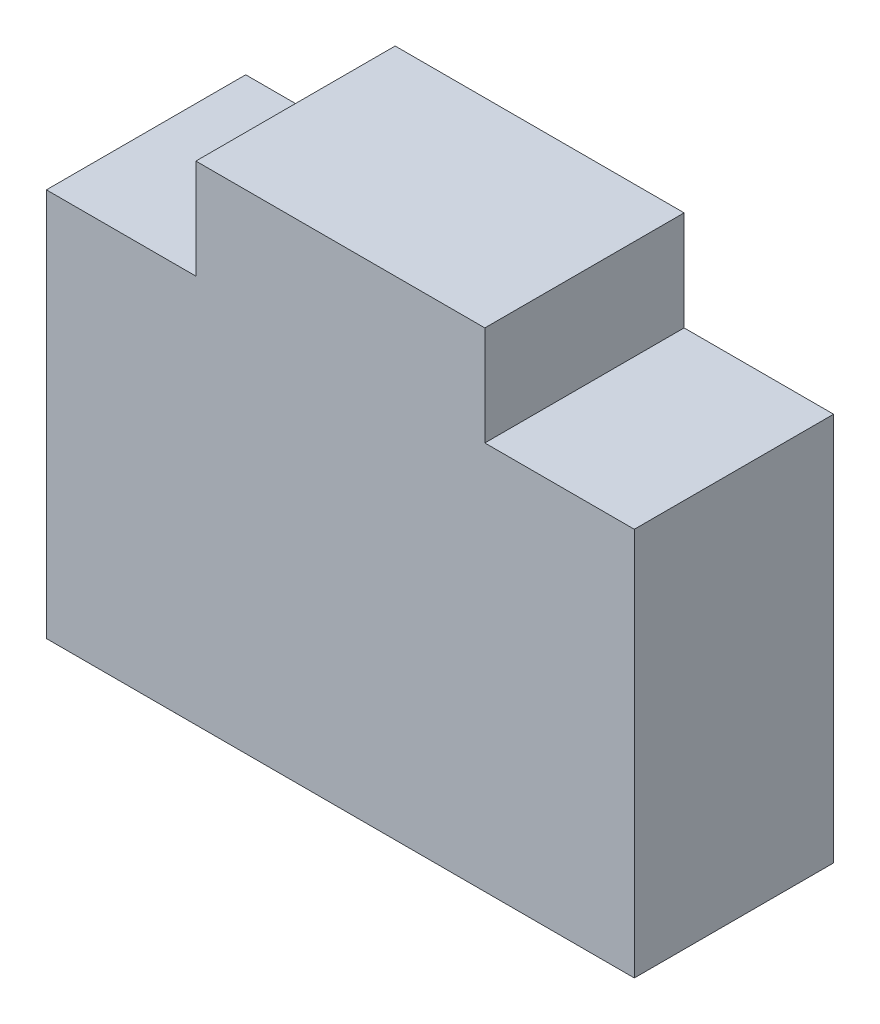
ISO-10303-21;
HEADER;
FILE_DESCRIPTION(('STEP AP214'),'2;1');
FILE_NAME('part.step','',(''),(''),'','','');
FILE_SCHEMA(('AUTOMOTIVE_DESIGN { 1 0 10303 214 1 1 1 1 }'));
ENDSEC;
DATA;
#1=APPLICATION_CONTEXT('core data for automotive mechanical design processes');
#2=APPLICATION_PROTOCOL_DEFINITION('international standard','automotive_design',2000,#1);
#3=PRODUCT_CONTEXT('',#1,'mechanical');
#4=PRODUCT('Part','Part','',(#3));
#5=PRODUCT_RELATED_PRODUCT_CATEGORY('part','',(#4));
#6=PRODUCT_DEFINITION_FORMATION('','',#4);
#7=PRODUCT_DEFINITION_CONTEXT('part definition',#1,'design');
#8=PRODUCT_DEFINITION('design','',#6,#7);
#9=PRODUCT_DEFINITION_SHAPE('','',#8);
#10=(LENGTH_UNIT() NAMED_UNIT(*) SI_UNIT(.MILLI.,.METRE.));
#11=(NAMED_UNIT(*) PLANE_ANGLE_UNIT() SI_UNIT($,.RADIAN.));
#12=(NAMED_UNIT(*) SI_UNIT($,.STERADIAN.) SOLID_ANGLE_UNIT());
#13=UNCERTAINTY_MEASURE_WITH_UNIT(LENGTH_MEASURE(1.E-05),#10,'distance_accuracy_value','');
#14=(GEOMETRIC_REPRESENTATION_CONTEXT(3) GLOBAL_UNCERTAINTY_ASSIGNED_CONTEXT((#13)) GLOBAL_UNIT_ASSIGNED_CONTEXT((#10,
#11,#12)) REPRESENTATION_CONTEXT('',''));
#15=CARTESIAN_POINT('',(0.,0.,0.));
#16=DIRECTION('',(0.,0.,1.));
#17=DIRECTION('',(1.,0.,0.));
#18=AXIS2_PLACEMENT_3D('',#15,#16,#17);
#19=CARTESIAN_POINT('',(1.45,0.,2.));
#20=DIRECTION('',(-1.,0.,0.));
#21=DIRECTION('',(0.,-1.,0.));
#22=AXIS2_PLACEMENT_3D('',#19,#20,#21);
#23=PLANE('',#22);
#24=DIRECTION('',(0.,1.,0.));
#25=VECTOR('',#24,1.);
#26=CARTESIAN_POINT('',(1.45,0.,0.));
#27=LINE('',#26,#25);
#28=CARTESIAN_POINT('',(1.45,-1.,0.));
#29=VERTEX_POINT('',#28);
#30=CARTESIAN_POINT('',(1.45,0.,0.));
#31=VERTEX_POINT('',#30);
#32=EDGE_CURVE('E129',#29,#31,#27,.T.);
#33=ORIENTED_EDGE('',*,*,#32,.T.);
#34=DIRECTION('',(0.,0.,-1.));
#35=VECTOR('',#34,1.);
#36=CARTESIAN_POINT('',(1.45,0.,2.));
#37=LINE('',#36,#35);
#38=CARTESIAN_POINT('',(1.45,0.,2.));
#39=VERTEX_POINT('',#38);
#40=EDGE_CURVE('E11',#39,#31,#37,.T.);
#41=ORIENTED_EDGE('',*,*,#40,.F.);
#42=DIRECTION('',(0.,1.,0.));
#43=VECTOR('',#42,1.);
#44=CARTESIAN_POINT('',(1.45,0.,2.));
#45=LINE('',#44,#43);
#46=CARTESIAN_POINT('',(1.45,-1.,2.));
#47=VERTEX_POINT('',#46);
#48=EDGE_CURVE('E143',#47,#39,#45,.T.);
#49=ORIENTED_EDGE('',*,*,#48,.F.);
#50=DIRECTION('',(0.,0.,-1.));
#51=VECTOR('',#50,1.);
#52=CARTESIAN_POINT('',(1.45,-1.,2.));
#53=LINE('',#52,#51);
#54=EDGE_CURVE('E125',#47,#29,#53,.T.);
#55=ORIENTED_EDGE('',*,*,#54,.T.);
#56=EDGE_LOOP('',(#33,#41,#49,#55));
#57=FACE_BOUND('',#56,.T.);
#58=ADVANCED_FACE('F33',(#57),#23,.F.);
#59=CARTESIAN_POINT('',(-1.45,0.,2.));
#60=DIRECTION('',(0.,-1.,0.));
#61=DIRECTION('',(0.,0.,-1.));
#62=AXIS2_PLACEMENT_3D('',#59,#60,#61);
#63=PLANE('',#62);
#64=DIRECTION('',(-1.,0.,0.));
#65=VECTOR('',#64,1.);
#66=CARTESIAN_POINT('',(-1.45,0.,0.));
#67=LINE('',#66,#65);
#68=CARTESIAN_POINT('',(-1.45,0.,0.));
#69=VERTEX_POINT('',#68);
#70=EDGE_CURVE('E132',#31,#69,#67,.T.);
#71=ORIENTED_EDGE('',*,*,#70,.T.);
#72=DIRECTION('',(0.,0.,-1.));
#73=VECTOR('',#72,1.);
#74=CARTESIAN_POINT('',(-1.45,0.,2.));
#75=LINE('',#74,#73);
#76=CARTESIAN_POINT('',(-1.45,0.,2.));
#77=VERTEX_POINT('',#76);
#78=EDGE_CURVE('E41',#77,#69,#75,.T.);
#79=ORIENTED_EDGE('',*,*,#78,.F.);
#80=DIRECTION('',(-1.,0.,0.));
#81=VECTOR('',#80,1.);
#82=CARTESIAN_POINT('',(-1.45,0.,2.));
#83=LINE('',#82,#81);
#84=EDGE_CURVE('E92',#39,#77,#83,.T.);
#85=ORIENTED_EDGE('',*,*,#84,.F.);
#86=ORIENTED_EDGE('',*,*,#40,.T.);
#87=EDGE_LOOP('',(#71,#79,#85,#86));
#88=FACE_BOUND('',#87,.T.);
#89=ADVANCED_FACE('F178',(#88),#63,.F.);
#90=CARTESIAN_POINT('',(-1.45,0.,2.));
#91=DIRECTION('',(1.,0.,0.));
#92=DIRECTION('',(0.,1.,0.));
#93=AXIS2_PLACEMENT_3D('',#90,#91,#92);
#94=PLANE('',#93);
#95=DIRECTION('',(0.,-1.,0.));
#96=VECTOR('',#95,1.);
#97=CARTESIAN_POINT('',(-1.45,0.,0.));
#98=LINE('',#97,#96);
#99=CARTESIAN_POINT('',(-1.44999999999999,-1.,0.));
#100=VERTEX_POINT('',#99);
#101=EDGE_CURVE('E134',#69,#100,#98,.T.);
#102=ORIENTED_EDGE('',*,*,#101,.T.);
#103=DIRECTION('',(0.,0.,-1.));
#104=VECTOR('',#103,1.);
#105=CARTESIAN_POINT('',(-1.44999999999999,-1.,2.));
#106=LINE('',#105,#104);
#107=CARTESIAN_POINT('',(-1.44999999999999,-1.,2.));
#108=VERTEX_POINT('',#107);
#109=EDGE_CURVE('E150',#108,#100,#106,.T.);
#110=ORIENTED_EDGE('',*,*,#109,.F.);
#111=DIRECTION('',(0.,-1.,0.));
#112=VECTOR('',#111,1.);
#113=CARTESIAN_POINT('',(-1.45,0.,2.));
#114=LINE('',#113,#112);
#115=EDGE_CURVE('E158',#77,#108,#114,.T.);
#116=ORIENTED_EDGE('',*,*,#115,.F.);
#117=ORIENTED_EDGE('',*,*,#78,.T.);
#118=EDGE_LOOP('',(#102,#110,#116,#117));
#119=FACE_BOUND('',#118,.T.);
#120=ADVANCED_FACE('F156',(#119),#94,.F.);
#121=CARTESIAN_POINT('',(-1.44999999999999,-1.,2.));
#122=DIRECTION('',(0.,-1.,0.));
#123=DIRECTION('',(0.,0.,-1.));
#124=AXIS2_PLACEMENT_3D('',#121,#122,#123);
#125=PLANE('',#124);
#126=DIRECTION('',(-1.,0.,0.));
#127=VECTOR('',#126,1.);
#128=CARTESIAN_POINT('',(-1.44999999999999,-1.,0.));
#129=LINE('',#128,#127);
#130=CARTESIAN_POINT('',(-2.94999999999999,-1.,0.));
#131=VERTEX_POINT('',#130);
#132=EDGE_CURVE('E136',#100,#131,#129,.T.);
#133=ORIENTED_EDGE('',*,*,#132,.T.);
#134=DIRECTION('',(0.,0.,-1.));
#135=VECTOR('',#134,1.);
#136=CARTESIAN_POINT('',(-2.94999999999999,-1.,2.));
#137=LINE('',#136,#135);
#138=CARTESIAN_POINT('',(-2.94999999999999,-1.,2.));
#139=VERTEX_POINT('',#138);
#140=EDGE_CURVE('E147',#139,#131,#137,.T.);
#141=ORIENTED_EDGE('',*,*,#140,.F.);
#142=DIRECTION('',(-1.,0.,0.));
#143=VECTOR('',#142,1.);
#144=CARTESIAN_POINT('',(-1.44999999999999,-1.,2.));
#145=LINE('',#144,#143);
#146=EDGE_CURVE('E170',#108,#139,#145,.T.);
#147=ORIENTED_EDGE('',*,*,#146,.F.);
#148=ORIENTED_EDGE('',*,*,#109,.T.);
#149=EDGE_LOOP('',(#133,#141,#147,#148));
#150=FACE_BOUND('',#149,.T.);
#151=ADVANCED_FACE('F166',(#150),#125,.F.);
#152=CARTESIAN_POINT('',(-2.94999999999999,-1.,2.));
#153=DIRECTION('',(1.,0.,0.));
#154=DIRECTION('',(0.,1.,0.));
#155=AXIS2_PLACEMENT_3D('',#152,#153,#154);
#156=PLANE('',#155);
#157=DIRECTION('',(0.,-1.,0.));
#158=VECTOR('',#157,1.);
#159=CARTESIAN_POINT('',(-2.94999999999999,-1.,0.));
#160=LINE('',#159,#158);
#161=CARTESIAN_POINT('',(-2.95,-4.9,0.));
#162=VERTEX_POINT('',#161);
#163=EDGE_CURVE('E138',#131,#162,#160,.T.);
#164=ORIENTED_EDGE('',*,*,#163,.T.);
#165=DIRECTION('',(0.,0.,-1.));
#166=VECTOR('',#165,1.);
#167=CARTESIAN_POINT('',(-2.95,-4.9,2.));
#168=LINE('',#167,#166);
#169=CARTESIAN_POINT('',(-2.95,-4.9,2.));
#170=VERTEX_POINT('',#169);
#171=EDGE_CURVE('E120',#170,#162,#168,.T.);
#172=ORIENTED_EDGE('',*,*,#171,.F.);
#173=DIRECTION('',(0.,-1.,0.));
#174=VECTOR('',#173,1.);
#175=CARTESIAN_POINT('',(-2.94999999999999,-1.,2.));
#176=LINE('',#175,#174);
#177=EDGE_CURVE('E111',#139,#170,#176,.T.);
#178=ORIENTED_EDGE('',*,*,#177,.F.);
#179=ORIENTED_EDGE('',*,*,#140,.T.);
#180=EDGE_LOOP('',(#164,#172,#178,#179));
#181=FACE_BOUND('',#180,.T.);
#182=ADVANCED_FACE('F169',(#181),#156,.F.);
#183=CARTESIAN_POINT('',(2.95,-4.9,2.));
#184=DIRECTION('',(0.,1.,0.));
#185=DIRECTION('',(0.,0.,1.));
#186=AXIS2_PLACEMENT_3D('',#183,#184,#185);
#187=PLANE('',#186);
#188=DIRECTION('',(1.,0.,0.));
#189=VECTOR('',#188,1.);
#190=CARTESIAN_POINT('',(2.95,-4.9,0.));
#191=LINE('',#190,#189);
#192=CARTESIAN_POINT('',(2.95,-4.9,0.));
#193=VERTEX_POINT('',#192);
#194=EDGE_CURVE('E119',#162,#193,#191,.T.);
#195=ORIENTED_EDGE('',*,*,#194,.T.);
#196=DIRECTION('',(0.,0.,-1.));
#197=VECTOR('',#196,1.);
#198=CARTESIAN_POINT('',(2.95,-4.9,2.));
#199=LINE('',#198,#197);
#200=CARTESIAN_POINT('',(2.95,-4.9,2.));
#201=VERTEX_POINT('',#200);
#202=EDGE_CURVE('E116',#201,#193,#199,.T.);
#203=ORIENTED_EDGE('',*,*,#202,.F.);
#204=DIRECTION('',(1.,0.,0.));
#205=VECTOR('',#204,1.);
#206=CARTESIAN_POINT('',(2.95,-4.9,2.));
#207=LINE('',#206,#205);
#208=EDGE_CURVE('E105',#170,#201,#207,.T.);
#209=ORIENTED_EDGE('',*,*,#208,.F.);
#210=ORIENTED_EDGE('',*,*,#171,.T.);
#211=EDGE_LOOP('',(#195,#203,#209,#210));
#212=FACE_BOUND('',#211,.T.);
#213=ADVANCED_FACE('F117',(#212),#187,.F.);
#214=CARTESIAN_POINT('',(2.95,-1.,2.));
#215=DIRECTION('',(-1.,0.,0.));
#216=DIRECTION('',(0.,-1.,0.));
#217=AXIS2_PLACEMENT_3D('',#214,#215,#216);
#218=PLANE('',#217);
#219=DIRECTION('',(0.,1.,0.));
#220=VECTOR('',#219,1.);
#221=CARTESIAN_POINT('',(2.95,-1.,0.));
#222=LINE('',#221,#220);
#223=CARTESIAN_POINT('',(2.95,-1.,0.));
#224=VERTEX_POINT('',#223);
#225=EDGE_CURVE('E78',#193,#224,#222,.T.);
#226=ORIENTED_EDGE('',*,*,#225,.T.);
#227=DIRECTION('',(0.,0.,-1.));
#228=VECTOR('',#227,1.);
#229=CARTESIAN_POINT('',(2.95,-1.,2.));
#230=LINE('',#229,#228);
#231=CARTESIAN_POINT('',(2.95,-1.,2.));
#232=VERTEX_POINT('',#231);
#233=EDGE_CURVE('E121',#232,#224,#230,.T.);
#234=ORIENTED_EDGE('',*,*,#233,.F.);
#235=DIRECTION('',(0.,1.,0.));
#236=VECTOR('',#235,1.);
#237=CARTESIAN_POINT('',(2.95,-1.,2.));
#238=LINE('',#237,#236);
#239=EDGE_CURVE('E109',#201,#232,#238,.T.);
#240=ORIENTED_EDGE('',*,*,#239,.F.);
#241=ORIENTED_EDGE('',*,*,#202,.T.);
#242=EDGE_LOOP('',(#226,#234,#240,#241));
#243=FACE_BOUND('',#242,.T.);
#244=ADVANCED_FACE('F123',(#243),#218,.F.);
#245=CARTESIAN_POINT('',(1.45,-1.,2.));
#246=DIRECTION('',(0.,-1.,0.));
#247=DIRECTION('',(0.,0.,-1.));
#248=AXIS2_PLACEMENT_3D('',#245,#246,#247);
#249=PLANE('',#248);
#250=DIRECTION('',(-1.,0.,0.));
#251=VECTOR('',#250,1.);
#252=CARTESIAN_POINT('',(1.45,-1.,0.));
#253=LINE('',#252,#251);
#254=EDGE_CURVE('E84',#224,#29,#253,.T.);
#255=ORIENTED_EDGE('',*,*,#254,.T.);
#256=ORIENTED_EDGE('',*,*,#54,.F.);
#257=DIRECTION('',(-1.,0.,0.));
#258=VECTOR('',#257,1.);
#259=CARTESIAN_POINT('',(1.45,-1.,2.));
#260=LINE('',#259,#258);
#261=EDGE_CURVE('E49',#232,#47,#260,.T.);
#262=ORIENTED_EDGE('',*,*,#261,.F.);
#263=ORIENTED_EDGE('',*,*,#233,.T.);
#264=EDGE_LOOP('',(#255,#256,#262,#263));
#265=FACE_BOUND('',#264,.T.);
#266=ADVANCED_FACE('F194',(#265),#249,.F.);
#267=CARTESIAN_POINT('',(0.,0.,2.));
#268=DIRECTION('',(0.,0.,1.));
#269=DIRECTION('',(1.,0.,0.));
#270=AXIS2_PLACEMENT_3D('',#267,#268,#269);
#271=PLANE('',#270);
#272=ORIENTED_EDGE('',*,*,#48,.T.);
#273=ORIENTED_EDGE('',*,*,#84,.T.);
#274=ORIENTED_EDGE('',*,*,#115,.T.);
#275=ORIENTED_EDGE('',*,*,#146,.T.);
#276=ORIENTED_EDGE('',*,*,#177,.T.);
#277=ORIENTED_EDGE('',*,*,#208,.T.);
#278=ORIENTED_EDGE('',*,*,#239,.T.);
#279=ORIENTED_EDGE('',*,*,#261,.T.);
#280=EDGE_LOOP('',(#272,#273,#274,#275,#276,#277,#278,#279));
#281=FACE_BOUND('',#280,.T.);
#282=ADVANCED_FACE('F107',(#281),#271,.T.);
#283=CARTESIAN_POINT('',(0.,0.,0.));
#284=DIRECTION('',(0.,0.,1.));
#285=DIRECTION('',(1.,0.,0.));
#286=AXIS2_PLACEMENT_3D('',#283,#284,#285);
#287=PLANE('',#286);
#288=ORIENTED_EDGE('',*,*,#32,.F.);
#289=ORIENTED_EDGE('',*,*,#254,.F.);
#290=ORIENTED_EDGE('',*,*,#225,.F.);
#291=ORIENTED_EDGE('',*,*,#194,.F.);
#292=ORIENTED_EDGE('',*,*,#163,.F.);
#293=ORIENTED_EDGE('',*,*,#132,.F.);
#294=ORIENTED_EDGE('',*,*,#101,.F.);
#295=ORIENTED_EDGE('',*,*,#70,.F.);
#296=EDGE_LOOP('',(#288,#289,#290,#291,#292,#293,#294,#295));
#297=FACE_BOUND('',#296,.T.);
#298=ADVANCED_FACE('F162',(#297),#287,.F.);
#299=CLOSED_SHELL('',(#58,#89,#120,#151,#182,#213,#244,#266,#282,#298));
#300=MANIFOLD_SOLID_BREP('B2',#299);
#301=ADVANCED_BREP_SHAPE_REPRESENTATION('',(#18,#300),#14);
#302=SHAPE_DEFINITION_REPRESENTATION(#9,#301);
ENDSEC;
END-ISO-10303-21;
